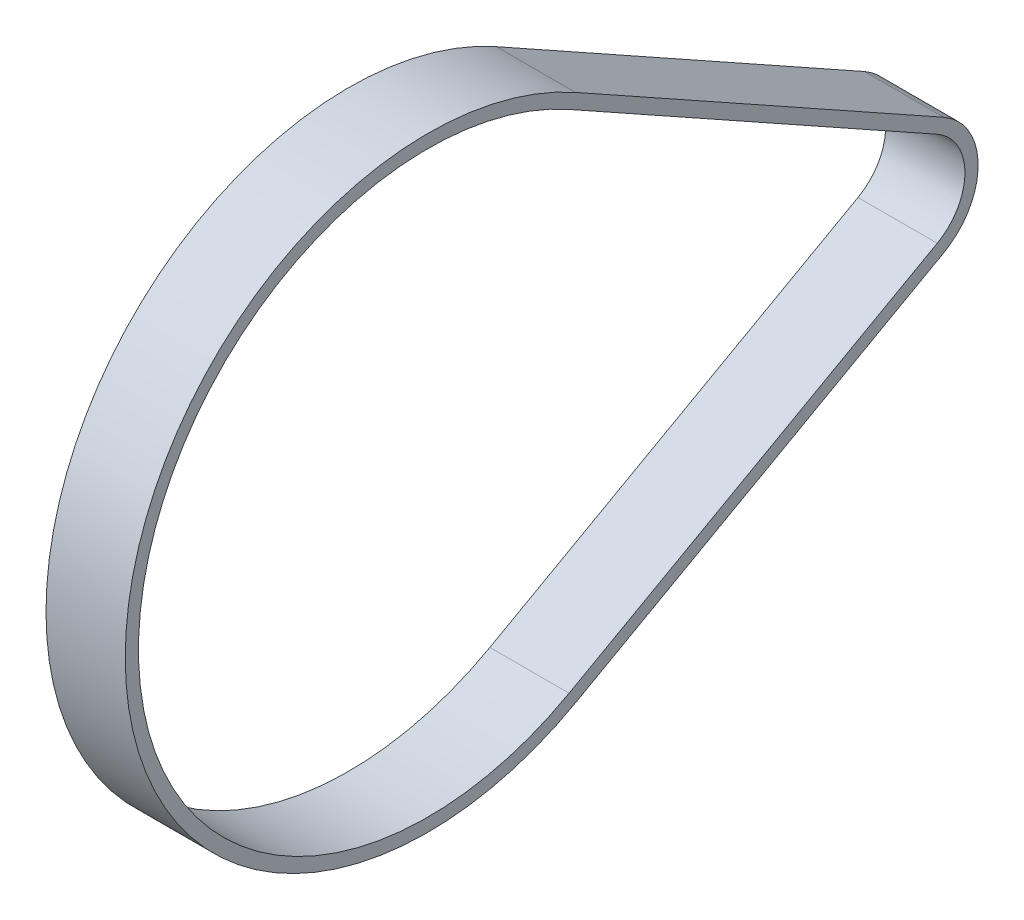
ISO-10303-21;
HEADER;
FILE_DESCRIPTION(('STEP AP214'),'2;1');
FILE_NAME('part.step','',(''),(''),'','','');
FILE_SCHEMA(('AUTOMOTIVE_DESIGN { 1 0 10303 214 1 1 1 1 }'));
ENDSEC;
DATA;
#1=APPLICATION_CONTEXT('core data for automotive mechanical design processes');
#2=APPLICATION_PROTOCOL_DEFINITION('international standard','automotive_design',2000,#1);
#3=PRODUCT_CONTEXT('',#1,'mechanical');
#4=PRODUCT('Part','Part','',(#3));
#5=PRODUCT_RELATED_PRODUCT_CATEGORY('part','',(#4));
#6=PRODUCT_DEFINITION_FORMATION('','',#4);
#7=PRODUCT_DEFINITION_CONTEXT('part definition',#1,'design');
#8=PRODUCT_DEFINITION('design','',#6,#7);
#9=PRODUCT_DEFINITION_SHAPE('','',#8);
#10=(LENGTH_UNIT() NAMED_UNIT(*) SI_UNIT(.MILLI.,.METRE.));
#11=(NAMED_UNIT(*) PLANE_ANGLE_UNIT() SI_UNIT($,.RADIAN.));
#12=(NAMED_UNIT(*) SI_UNIT($,.STERADIAN.) SOLID_ANGLE_UNIT());
#13=UNCERTAINTY_MEASURE_WITH_UNIT(LENGTH_MEASURE(1.E-05),#10,'distance_accuracy_value','');
#14=(GEOMETRIC_REPRESENTATION_CONTEXT(3) GLOBAL_UNCERTAINTY_ASSIGNED_CONTEXT((#13)) GLOBAL_UNIT_ASSIGNED_CONTEXT((#10,
#11,#12)) REPRESENTATION_CONTEXT('',''));
#15=CARTESIAN_POINT('',(0.,0.,0.));
#16=DIRECTION('',(0.,0.,1.));
#17=DIRECTION('',(1.,0.,0.));
#18=AXIS2_PLACEMENT_3D('',#15,#16,#17);
#19=CARTESIAN_POINT('',(7.5,0.,45.7021798706819));
#20=DIRECTION('',(1.,0.,0.));
#21=DIRECTION('',(0.,0.,-1.));
#22=AXIS2_PLACEMENT_3D('',#19,#20,#21);
#23=PLANE('',#22);
#24=CARTESIAN_POINT('',(7.5,0.,45.7021798706819));
#25=DIRECTION('',(1.,0.,0.));
#26=DIRECTION('',(0.,0.,-1.));
#27=AXIS2_PLACEMENT_3D('',#24,#25,#26);
#28=CIRCLE('',#27,57.2957795130823);
#29=CARTESIAN_POINT('',(7.5,50.0249465617594,17.7681312649953));
#30=VERTEX_POINT('',#29);
#31=CARTESIAN_POINT('',(7.5,-50.0249465617594,17.7681312649954));
#32=VERTEX_POINT('',#31);
#33=EDGE_CURVE('E153',#30,#32,#28,.T.);
#34=ORIENTED_EDGE('',*,*,#33,.T.);
#35=DIRECTION('',(0.,0.487541121581361,-0.873100025636919));
#36=VECTOR('',#35,1.);
#37=CARTESIAN_POINT('',(7.5,-50.0249465617594,17.7681312649954));
#38=LINE('',#37,#36);
#39=CARTESIAN_POINT('',(7.5,-11.1166547915021,-51.9097462275011));
#40=VERTEX_POINT('',#39);
#41=EDGE_CURVE('E157',#32,#40,#38,.T.);
#42=ORIENTED_EDGE('',*,*,#41,.T.);
#43=CARTESIAN_POINT('',(7.5,0.,-45.7021798706819));
#44=DIRECTION('',(1.,0.,0.));
#45=DIRECTION('',(0.,0.,-1.));
#46=AXIS2_PLACEMENT_3D('',#43,#44,#45);
#47=CIRCLE('',#46,12.7323954473516);
#48=CARTESIAN_POINT('',(7.5,11.1166547915021,-51.9097462275011));
#49=VERTEX_POINT('',#48);
#50=EDGE_CURVE('E161',#40,#49,#47,.T.);
#51=ORIENTED_EDGE('',*,*,#50,.T.);
#52=DIRECTION('',(0.,0.487541121581361,0.873100025636919));
#53=VECTOR('',#52,1.);
#54=CARTESIAN_POINT('',(7.5,50.0249465617594,17.7681312649953));
#55=LINE('',#54,#53);
#56=EDGE_CURVE('E164',#49,#30,#55,.T.);
#57=ORIENTED_EDGE('',*,*,#56,.T.);
#58=EDGE_LOOP('',(#34,#42,#51,#57));
#59=FACE_BOUND('',#58,.T.);
#60=DIRECTION('',(0.,0.487541121581361,-0.873100025636919));
#61=VECTOR('',#60,1.);
#62=CARTESIAN_POINT('',(7.5,-47.8421964976671,18.9869840689488));
#63=LINE('',#62,#61);
#64=CARTESIAN_POINT('',(7.5,-47.8421964976671,18.9869840689488));
#65=VERTEX_POINT('',#64);
#66=CARTESIAN_POINT('',(7.5,-8.93390472740982,-50.6908934235477));
#67=VERTEX_POINT('',#66);
#68=EDGE_CURVE('E114',#65,#67,#63,.T.);
#69=ORIENTED_EDGE('',*,*,#68,.F.);
#70=CARTESIAN_POINT('',(7.5,0.,45.7021798706819));
#71=DIRECTION('',(1.,0.,0.));
#72=DIRECTION('',(0.,0.,-1.));
#73=AXIS2_PLACEMENT_3D('',#70,#71,#72);
#74=CIRCLE('',#73,54.7957795130823);
#75=CARTESIAN_POINT('',(7.5,47.8421964976671,18.9869840689487));
#76=VERTEX_POINT('',#75);
#77=EDGE_CURVE('E105',#76,#65,#74,.T.);
#78=ORIENTED_EDGE('',*,*,#77,.F.);
#79=DIRECTION('',(0.,0.487541121581361,0.873100025636919));
#80=VECTOR('',#79,1.);
#81=CARTESIAN_POINT('',(7.5,47.8421964976671,18.9869840689487));
#82=LINE('',#81,#80);
#83=CARTESIAN_POINT('',(7.5,8.93390472740976,-50.6908934235477));
#84=VERTEX_POINT('',#83);
#85=EDGE_CURVE('E131',#84,#76,#82,.T.);
#86=ORIENTED_EDGE('',*,*,#85,.F.);
#87=CARTESIAN_POINT('',(7.5,0.,-45.7021798706819));
#88=DIRECTION('',(1.,0.,0.));
#89=DIRECTION('',(0.,0.,-1.));
#90=AXIS2_PLACEMENT_3D('',#87,#88,#89);
#91=CIRCLE('',#90,10.2323954473516);
#92=EDGE_CURVE('E127',#67,#84,#91,.T.);
#93=ORIENTED_EDGE('',*,*,#92,.F.);
#94=EDGE_LOOP('',(#69,#78,#86,#93));
#95=FACE_BOUND('',#94,.T.);
#96=ADVANCED_FACE('F39',(#59,#95),#23,.T.);
#97=CARTESIAN_POINT('',(-7.5,0.,45.7021798706819));
#98=DIRECTION('',(1.,0.,0.));
#99=DIRECTION('',(0.,0.,-1.));
#100=AXIS2_PLACEMENT_3D('',#97,#98,#99);
#101=PLANE('',#100);
#102=CARTESIAN_POINT('',(-7.5,0.,45.7021798706819));
#103=DIRECTION('',(1.,0.,0.));
#104=DIRECTION('',(0.,0.,-1.));
#105=AXIS2_PLACEMENT_3D('',#102,#103,#104);
#106=CIRCLE('',#105,57.2957795130823);
#107=CARTESIAN_POINT('',(-7.5,50.0249465617594,17.7681312649953));
#108=VERTEX_POINT('',#107);
#109=CARTESIAN_POINT('',(-7.5,-50.0249465617594,17.7681312649954));
#110=VERTEX_POINT('',#109);
#111=EDGE_CURVE('E123',#108,#110,#106,.T.);
#112=ORIENTED_EDGE('',*,*,#111,.F.);
#113=DIRECTION('',(0.,0.487541121581361,0.873100025636919));
#114=VECTOR('',#113,1.);
#115=CARTESIAN_POINT('',(-7.5,50.0249465617594,17.7681312649953));
#116=LINE('',#115,#114);
#117=CARTESIAN_POINT('',(-7.5,11.1166547915021,-51.9097462275011));
#118=VERTEX_POINT('',#117);
#119=EDGE_CURVE('E158',#118,#108,#116,.T.);
#120=ORIENTED_EDGE('',*,*,#119,.F.);
#121=CARTESIAN_POINT('',(-7.5,0.,-45.7021798706819));
#122=DIRECTION('',(1.,0.,0.));
#123=DIRECTION('',(0.,0.,-1.));
#124=AXIS2_PLACEMENT_3D('',#121,#122,#123);
#125=CIRCLE('',#124,12.7323954473516);
#126=CARTESIAN_POINT('',(-7.5,-11.1166547915021,-51.9097462275011));
#127=VERTEX_POINT('',#126);
#128=EDGE_CURVE('E174',#127,#118,#125,.T.);
#129=ORIENTED_EDGE('',*,*,#128,.F.);
#130=DIRECTION('',(0.,0.487541121581361,-0.873100025636919));
#131=VECTOR('',#130,1.);
#132=CARTESIAN_POINT('',(-7.5,-50.0249465617594,17.7681312649954));
#133=LINE('',#132,#131);
#134=EDGE_CURVE('E171',#110,#127,#133,.T.);
#135=ORIENTED_EDGE('',*,*,#134,.F.);
#136=EDGE_LOOP('',(#112,#120,#129,#135));
#137=FACE_BOUND('',#136,.T.);
#138=CARTESIAN_POINT('',(-7.5,0.,45.7021798706819));
#139=DIRECTION('',(1.,0.,0.));
#140=DIRECTION('',(0.,0.,-1.));
#141=AXIS2_PLACEMENT_3D('',#138,#139,#140);
#142=CIRCLE('',#141,54.7957795130823);
#143=CARTESIAN_POINT('',(-7.5,47.8421964976671,18.9869840689487));
#144=VERTEX_POINT('',#143);
#145=CARTESIAN_POINT('',(-7.5,-47.8421964976671,18.9869840689488));
#146=VERTEX_POINT('',#145);
#147=EDGE_CURVE('E63',#144,#146,#142,.T.);
#148=ORIENTED_EDGE('',*,*,#147,.T.);
#149=DIRECTION('',(0.,0.487541121581361,-0.873100025636919));
#150=VECTOR('',#149,1.);
#151=CARTESIAN_POINT('',(-7.5,-47.8421964976671,18.9869840689488));
#152=LINE('',#151,#150);
#153=CARTESIAN_POINT('',(-7.5,-8.93390472740982,-50.6908934235477));
#154=VERTEX_POINT('',#153);
#155=EDGE_CURVE('E121',#146,#154,#152,.T.);
#156=ORIENTED_EDGE('',*,*,#155,.T.);
#157=CARTESIAN_POINT('',(-7.5,0.,-45.7021798706819));
#158=DIRECTION('',(1.,0.,0.));
#159=DIRECTION('',(0.,0.,-1.));
#160=AXIS2_PLACEMENT_3D('',#157,#158,#159);
#161=CIRCLE('',#160,10.2323954473516);
#162=CARTESIAN_POINT('',(-7.5,8.93390472740978,-50.6908934235477));
#163=VERTEX_POINT('',#162);
#164=EDGE_CURVE('E140',#154,#163,#161,.T.);
#165=ORIENTED_EDGE('',*,*,#164,.T.);
#166=DIRECTION('',(0.,0.487541121581361,0.873100025636919));
#167=VECTOR('',#166,1.);
#168=CARTESIAN_POINT('',(-7.5,47.8421964976671,18.9869840689487));
#169=LINE('',#168,#167);
#170=EDGE_CURVE('E115',#163,#144,#169,.T.);
#171=ORIENTED_EDGE('',*,*,#170,.T.);
#172=EDGE_LOOP('',(#148,#156,#165,#171));
#173=FACE_BOUND('',#172,.T.);
#174=ADVANCED_FACE('F197',(#137,#173),#101,.F.);
#175=CARTESIAN_POINT('',(7.5,0.,45.7021798706819));
#176=DIRECTION('',(-1.,0.,0.));
#177=DIRECTION('',(0.,0.,1.));
#178=AXIS2_PLACEMENT_3D('',#175,#176,#177);
#179=CYLINDRICAL_SURFACE('',#178,57.2957795130823);
#180=ORIENTED_EDGE('',*,*,#111,.T.);
#181=DIRECTION('',(-1.,0.,0.));
#182=VECTOR('',#181,1.);
#183=CARTESIAN_POINT('',(7.5,-50.0249465617594,17.7681312649954));
#184=LINE('',#183,#182);
#185=EDGE_CURVE('E11',#32,#110,#184,.T.);
#186=ORIENTED_EDGE('',*,*,#185,.F.);
#187=ORIENTED_EDGE('',*,*,#33,.F.);
#188=DIRECTION('',(-1.,0.,0.));
#189=VECTOR('',#188,1.);
#190=CARTESIAN_POINT('',(7.5,50.0249465617594,17.7681312649953));
#191=LINE('',#190,#189);
#192=EDGE_CURVE('E167',#30,#108,#191,.T.);
#193=ORIENTED_EDGE('',*,*,#192,.T.);
#194=EDGE_LOOP('',(#180,#186,#187,#193));
#195=FACE_BOUND('',#194,.T.);
#196=ADVANCED_FACE('F41',(#195),#179,.T.);
#197=CARTESIAN_POINT('',(7.5,-50.0249465617594,17.7681312649954));
#198=DIRECTION('',(0.,0.873100025636919,0.487541121581361));
#199=DIRECTION('',(0.,-0.487541121581361,0.873100025636919));
#200=AXIS2_PLACEMENT_3D('',#197,#198,#199);
#201=PLANE('',#200);
#202=ORIENTED_EDGE('',*,*,#134,.T.);
#203=DIRECTION('',(-1.,0.,0.));
#204=VECTOR('',#203,1.);
#205=CARTESIAN_POINT('',(7.5,-11.1166547915021,-51.9097462275011));
#206=LINE('',#205,#204);
#207=EDGE_CURVE('E48',#40,#127,#206,.T.);
#208=ORIENTED_EDGE('',*,*,#207,.F.);
#209=ORIENTED_EDGE('',*,*,#41,.F.);
#210=ORIENTED_EDGE('',*,*,#185,.T.);
#211=EDGE_LOOP('',(#202,#208,#209,#210));
#212=FACE_BOUND('',#211,.T.);
#213=ADVANCED_FACE('F207',(#212),#201,.F.);
#214=CARTESIAN_POINT('',(7.5,0.,-45.7021798706819));
#215=DIRECTION('',(-1.,0.,0.));
#216=DIRECTION('',(0.,0.,1.));
#217=AXIS2_PLACEMENT_3D('',#214,#215,#216);
#218=CYLINDRICAL_SURFACE('',#217,12.7323954473516);
#219=ORIENTED_EDGE('',*,*,#128,.T.);
#220=DIRECTION('',(-1.,0.,0.));
#221=VECTOR('',#220,1.);
#222=CARTESIAN_POINT('',(7.5,11.1166547915021,-51.9097462275011));
#223=LINE('',#222,#221);
#224=EDGE_CURVE('E182',#49,#118,#223,.T.);
#225=ORIENTED_EDGE('',*,*,#224,.F.);
#226=ORIENTED_EDGE('',*,*,#50,.F.);
#227=ORIENTED_EDGE('',*,*,#207,.T.);
#228=EDGE_LOOP('',(#219,#225,#226,#227));
#229=FACE_BOUND('',#228,.T.);
#230=ADVANCED_FACE('F191',(#229),#218,.T.);
#231=CARTESIAN_POINT('',(7.5,50.0249465617594,17.7681312649953));
#232=DIRECTION('',(0.,-0.873100025636919,0.487541121581361));
#233=DIRECTION('',(0.,-0.487541121581361,-0.873100025636919));
#234=AXIS2_PLACEMENT_3D('',#231,#232,#233);
#235=PLANE('',#234);
#236=ORIENTED_EDGE('',*,*,#119,.T.);
#237=ORIENTED_EDGE('',*,*,#192,.F.);
#238=ORIENTED_EDGE('',*,*,#56,.F.);
#239=ORIENTED_EDGE('',*,*,#224,.T.);
#240=EDGE_LOOP('',(#236,#237,#238,#239));
#241=FACE_BOUND('',#240,.T.);
#242=ADVANCED_FACE('F201',(#241),#235,.F.);
#243=CARTESIAN_POINT('',(7.5,0.,45.7021798706819));
#244=DIRECTION('',(-1.,0.,0.));
#245=DIRECTION('',(0.,0.,1.));
#246=AXIS2_PLACEMENT_3D('',#243,#244,#245);
#247=CYLINDRICAL_SURFACE('',#246,54.7957795130823);
#248=ORIENTED_EDGE('',*,*,#147,.F.);
#249=DIRECTION('',(-1.,0.,0.));
#250=VECTOR('',#249,1.);
#251=CARTESIAN_POINT('',(7.5,47.8421964976671,18.9869840689487));
#252=LINE('',#251,#250);
#253=EDGE_CURVE('E109',#76,#144,#252,.T.);
#254=ORIENTED_EDGE('',*,*,#253,.F.);
#255=ORIENTED_EDGE('',*,*,#77,.T.);
#256=DIRECTION('',(-1.,0.,0.));
#257=VECTOR('',#256,1.);
#258=CARTESIAN_POINT('',(7.5,-47.8421964976671,18.9869840689488));
#259=LINE('',#258,#257);
#260=EDGE_CURVE('E108',#65,#146,#259,.T.);
#261=ORIENTED_EDGE('',*,*,#260,.T.);
#262=EDGE_LOOP('',(#248,#254,#255,#261));
#263=FACE_BOUND('',#262,.T.);
#264=ADVANCED_FACE('F107',(#263),#247,.F.);
#265=CARTESIAN_POINT('',(7.5,-47.8421964976671,18.9869840689488));
#266=DIRECTION('',(0.,0.873100025636919,0.487541121581361));
#267=DIRECTION('',(0.,-0.487541121581361,0.873100025636919));
#268=AXIS2_PLACEMENT_3D('',#265,#266,#267);
#269=PLANE('',#268);
#270=ORIENTED_EDGE('',*,*,#155,.F.);
#271=ORIENTED_EDGE('',*,*,#260,.F.);
#272=ORIENTED_EDGE('',*,*,#68,.T.);
#273=DIRECTION('',(-1.,0.,0.));
#274=VECTOR('',#273,1.);
#275=CARTESIAN_POINT('',(7.5,-8.93390472740982,-50.6908934235477));
#276=LINE('',#275,#274);
#277=EDGE_CURVE('E124',#67,#154,#276,.T.);
#278=ORIENTED_EDGE('',*,*,#277,.T.);
#279=EDGE_LOOP('',(#270,#271,#272,#278));
#280=FACE_BOUND('',#279,.T.);
#281=ADVANCED_FACE('F118',(#280),#269,.T.);
#282=CARTESIAN_POINT('',(7.5,0.,-45.7021798706819));
#283=DIRECTION('',(-1.,0.,0.));
#284=DIRECTION('',(0.,0.,1.));
#285=AXIS2_PLACEMENT_3D('',#282,#283,#284);
#286=CYLINDRICAL_SURFACE('',#285,10.2323954473516);
#287=ORIENTED_EDGE('',*,*,#164,.F.);
#288=ORIENTED_EDGE('',*,*,#277,.F.);
#289=ORIENTED_EDGE('',*,*,#92,.T.);
#290=DIRECTION('',(-1.,0.,0.));
#291=VECTOR('',#290,1.);
#292=CARTESIAN_POINT('',(7.5,8.93390472740978,-50.6908934235477));
#293=LINE('',#292,#291);
#294=EDGE_CURVE('E55',#84,#163,#293,.T.);
#295=ORIENTED_EDGE('',*,*,#294,.T.);
#296=EDGE_LOOP('',(#287,#288,#289,#295));
#297=FACE_BOUND('',#296,.T.);
#298=ADVANCED_FACE('F230',(#297),#286,.F.);
#299=CARTESIAN_POINT('',(7.5,47.8421964976671,18.9869840689487));
#300=DIRECTION('',(0.,-0.873100025636919,0.487541121581361));
#301=DIRECTION('',(0.,-0.487541121581361,-0.873100025636919));
#302=AXIS2_PLACEMENT_3D('',#299,#300,#301);
#303=PLANE('',#302);
#304=ORIENTED_EDGE('',*,*,#170,.F.);
#305=ORIENTED_EDGE('',*,*,#294,.F.);
#306=ORIENTED_EDGE('',*,*,#85,.T.);
#307=ORIENTED_EDGE('',*,*,#253,.T.);
#308=EDGE_LOOP('',(#304,#305,#306,#307));
#309=FACE_BOUND('',#308,.T.);
#310=ADVANCED_FACE('F234',(#309),#303,.T.);
#311=CLOSED_SHELL('',(#96,#174,#196,#213,#230,#242,#264,#281,#298,#310));
#312=MANIFOLD_SOLID_BREP('B2',#311);
#313=ADVANCED_BREP_SHAPE_REPRESENTATION('',(#18,#312),#14);
#314=SHAPE_DEFINITION_REPRESENTATION(#9,#313);
ENDSEC;
END-ISO-10303-21;
